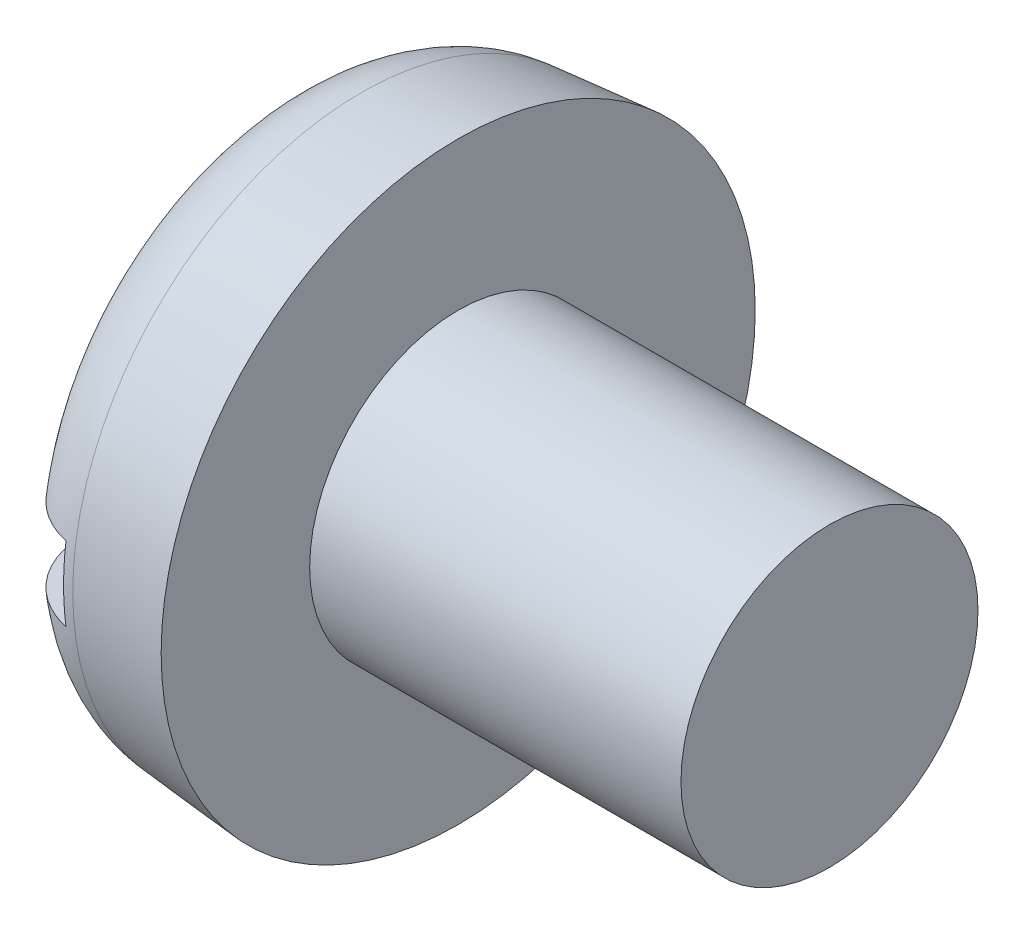
ISO-10303-21;
HEADER;
FILE_DESCRIPTION(('STEP AP214'),'2;1');
FILE_NAME('part.step','',(''),(''),'','','');
FILE_SCHEMA(('AUTOMOTIVE_DESIGN { 1 0 10303 214 1 1 1 1 }'));
ENDSEC;
DATA;
#1=APPLICATION_CONTEXT('core data for automotive mechanical design processes');
#2=APPLICATION_PROTOCOL_DEFINITION('international standard','automotive_design',2000,#1);
#3=PRODUCT_CONTEXT('',#1,'mechanical');
#4=PRODUCT('Part','Part','',(#3));
#5=PRODUCT_RELATED_PRODUCT_CATEGORY('part','',(#4));
#6=PRODUCT_DEFINITION_FORMATION('','',#4);
#7=PRODUCT_DEFINITION_CONTEXT('part definition',#1,'design');
#8=PRODUCT_DEFINITION('design','',#6,#7);
#9=PRODUCT_DEFINITION_SHAPE('','',#8);
#10=(LENGTH_UNIT() NAMED_UNIT(*) SI_UNIT(.MILLI.,.METRE.));
#11=(NAMED_UNIT(*) PLANE_ANGLE_UNIT() SI_UNIT($,.RADIAN.));
#12=(NAMED_UNIT(*) SI_UNIT($,.STERADIAN.) SOLID_ANGLE_UNIT());
#13=UNCERTAINTY_MEASURE_WITH_UNIT(LENGTH_MEASURE(1.E-05),#10,'distance_accuracy_value','');
#14=(GEOMETRIC_REPRESENTATION_CONTEXT(3) GLOBAL_UNCERTAINTY_ASSIGNED_CONTEXT((#13)) GLOBAL_UNIT_ASSIGNED_CONTEXT((#10,
#11,#12)) REPRESENTATION_CONTEXT('',''));
#15=CARTESIAN_POINT('',(0.,0.,0.));
#16=DIRECTION('',(0.,0.,1.));
#17=DIRECTION('',(1.,0.,0.));
#18=AXIS2_PLACEMENT_3D('',#15,#16,#17);
#19=CARTESIAN_POINT('',(0.,0.,0.));
#20=DIRECTION('',(-1.,0.,0.));
#21=DIRECTION('',(0.,0.,1.));
#22=AXIS2_PLACEMENT_3D('',#19,#20,#21);
#23=PLANE('',#22);
#24=DIRECTION('',(0.,0.,-1.));
#25=VECTOR('',#24,1.);
#26=CARTESIAN_POINT('',(0.,0.999999999999999,8.));
#27=LINE('',#26,#25);
#28=CARTESIAN_POINT('',(0.,0.999999999999999,5.28712114550961));
#29=VERTEX_POINT('',#28);
#30=CARTESIAN_POINT('',(0.,0.999999999999999,-5.28712114550961));
#31=VERTEX_POINT('',#30);
#32=EDGE_CURVE('E85',#29,#31,#27,.T.);
#33=ORIENTED_EDGE('',*,*,#32,.F.);
#34=CARTESIAN_POINT('',(0.,0.,0.));
#35=DIRECTION('',(-1.,0.,0.));
#36=DIRECTION('',(0.,0.,1.));
#37=AXIS2_PLACEMENT_3D('',#34,#35,#36);
#38=CIRCLE('',#37,5.38085959743375);
#39=EDGE_CURVE('E91',#29,#31,#38,.T.);
#40=ORIENTED_EDGE('',*,*,#39,.T.);
#41=EDGE_LOOP('',(#33,#40));
#42=FACE_BOUND('',#41,.T.);
#43=ADVANCED_FACE('F32',(#42),#23,.T.);
#44=CARTESIAN_POINT('',(-25.4,0.,0.));
#45=DIRECTION('',(-1.,0.,0.));
#46=DIRECTION('',(0.,0.,1.));
#47=AXIS2_PLACEMENT_3D('',#44,#45,#46);
#48=CYLINDRICAL_SURFACE('',#47,4.);
#49=CARTESIAN_POINT('',(14.8,0.,0.));
#50=DIRECTION('',(-1.,0.,0.));
#51=DIRECTION('',(0.,0.,1.));
#52=AXIS2_PLACEMENT_3D('',#49,#50,#51);
#53=CIRCLE('',#52,4.);
#54=CARTESIAN_POINT('',(14.8,0.,4.));
#55=VERTEX_POINT('',#54);
#56=EDGE_CURVE('E92',#55,#55,#53,.T.);
#57=ORIENTED_EDGE('',*,*,#56,.T.);
#58=EDGE_LOOP('',(#57));
#59=FACE_BOUND('',#58,.T.);
#60=CARTESIAN_POINT('',(4.8,0.,0.));
#61=DIRECTION('',(-1.,0.,0.));
#62=DIRECTION('',(0.,0.,1.));
#63=AXIS2_PLACEMENT_3D('',#60,#61,#62);
#64=CIRCLE('',#63,4.);
#65=CARTESIAN_POINT('',(4.8,0.,4.));
#66=VERTEX_POINT('',#65);
#67=EDGE_CURVE('E149',#66,#66,#64,.T.);
#68=ORIENTED_EDGE('',*,*,#67,.F.);
#69=EDGE_LOOP('',(#68));
#70=FACE_BOUND('',#69,.T.);
#71=ADVANCED_FACE('F137',(#59,#70),#48,.T.);
#72=CARTESIAN_POINT('',(14.8,4.,0.));
#73=DIRECTION('',(1.,0.,0.));
#74=DIRECTION('',(0.,0.,-1.));
#75=AXIS2_PLACEMENT_3D('',#72,#73,#74);
#76=PLANE('',#75);
#77=ORIENTED_EDGE('',*,*,#56,.F.);
#78=EDGE_LOOP('',(#77));
#79=FACE_BOUND('',#78,.T.);
#80=ADVANCED_FACE('F135',(#79),#76,.T.);
#81=DIRECTION('',(0.,0.,1.));
#82=VECTOR('',#81,1.);
#83=CARTESIAN_POINT('',(0.,-0.999999999999999,-8.));
#84=LINE('',#83,#82);
#85=CARTESIAN_POINT('',(0.,-0.999999999999999,-5.28712114550961));
#86=VERTEX_POINT('',#85);
#87=CARTESIAN_POINT('',(0.,-1.,5.28712114550961));
#88=VERTEX_POINT('',#87);
#89=EDGE_CURVE('E76',#86,#88,#84,.T.);
#90=ORIENTED_EDGE('',*,*,#89,.F.);
#91=EDGE_CURVE('E83',#86,#88,#38,.T.);
#92=ORIENTED_EDGE('',*,*,#91,.T.);
#93=EDGE_LOOP('',(#90,#92));
#94=FACE_BOUND('',#93,.T.);
#95=ADVANCED_FACE('F82',(#94),#23,.T.);
#96=CARTESIAN_POINT('',(0.,0.,0.));
#97=DIRECTION('',(1.,0.,0.));
#98=DIRECTION('',(0.,0.,-1.));
#99=AXIS2_PLACEMENT_3D('',#96,#97,#98);
#100=CONICAL_SURFACE('',#99,7.58005441507556,0.0872664625997166);
#101=CARTESIAN_POINT('',(2.19082621740561,0.,0.));
#102=DIRECTION('',(-1.,0.,0.));
#103=DIRECTION('',(0.,0.,1.));
#104=AXIS2_PLACEMENT_3D('',#101,#102,#103);
#105=CIRCLE('',#104,7.77172687285394);
#106=CARTESIAN_POINT('',(2.19082621740561,0.,7.77172687285394));
#107=VERTEX_POINT('',#106);
#108=EDGE_CURVE('E95',#107,#107,#105,.F.);
#109=ORIENTED_EDGE('',*,*,#108,.T.);
#110=EDGE_LOOP('',(#109));
#111=FACE_BOUND('',#110,.T.);
#112=CARTESIAN_POINT('',(4.8,0.,0.));
#113=DIRECTION('',(-1.,0.,0.));
#114=DIRECTION('',(0.,0.,1.));
#115=AXIS2_PLACEMENT_3D('',#112,#113,#114);
#116=CIRCLE('',#115,8.);
#117=CARTESIAN_POINT('',(4.8,0.,8.));
#118=VERTEX_POINT('',#117);
#119=EDGE_CURVE('E97',#118,#118,#116,.T.);
#120=ORIENTED_EDGE('',*,*,#119,.T.);
#121=EDGE_LOOP('',(#120));
#122=FACE_BOUND('',#121,.T.);
#123=ADVANCED_FACE('F128',(#111,#122),#100,.T.);
#124=CARTESIAN_POINT('',(4.8,4.,0.));
#125=DIRECTION('',(-1.,0.,0.));
#126=DIRECTION('',(0.,0.,1.));
#127=AXIS2_PLACEMENT_3D('',#124,#125,#126);
#128=PLANE('',#127);
#129=ORIENTED_EDGE('',*,*,#119,.F.);
#130=EDGE_LOOP('',(#129));
#131=FACE_BOUND('',#130,.T.);
#132=ORIENTED_EDGE('',*,*,#67,.T.);
#133=EDGE_LOOP('',(#132));
#134=FACE_BOUND('',#133,.T.);
#135=ADVANCED_FACE('F124',(#131,#134),#128,.F.);
#136=CARTESIAN_POINT('',(2.4,0.,0.));
#137=DIRECTION('',(-1.,0.,0.));
#138=DIRECTION('',(0.,0.,1.));
#139=AXIS2_PLACEMENT_3D('',#136,#137,#138);
#140=TOROIDAL_SURFACE('',#139,5.38085959743375,2.4);
#141=CARTESIAN_POINT('',(0.725255406221407,0.999999999999999,-7.02916208153497));
#142=CARTESIAN_POINT('',(0.82103971292507,0.999999999999999,-7.12340767349536));
#143=CARTESIAN_POINT('',(0.924805682146405,0.999999999999999,-7.20967378769888));
#144=CARTESIAN_POINT('',(1.14541756360663,0.999999999999999,-7.36365307010391));
#145=CARTESIAN_POINT('',(1.26227783081037,0.999999999999999,-7.43134559064638));
#146=CARTESIAN_POINT('',(1.50570820252025,0.999999999999999,-7.54609816898988));
#147=CARTESIAN_POINT('',(1.63227616123195,0.999999999999999,-7.59316277104451));
#148=CARTESIAN_POINT('',(1.8915043758024,0.999999999999999,-7.66527026246751));
#149=CARTESIAN_POINT('',(2.02416318956274,0.999999999999999,-7.69031833656536));
#150=CARTESIAN_POINT('',(2.29131695770764,0.999999999999999,-7.7176231673501));
#151=CARTESIAN_POINT('',(2.42580346116035,0.999999999999999,-7.71996263084353));
#152=CARTESIAN_POINT('',(2.69325801993518,0.999999999999999,-7.70199615393957));
#153=CARTESIAN_POINT('',(2.82622604430506,0.999999999999999,-7.68168975276478));
#154=CARTESIAN_POINT('',(3.08668283115957,0.999999999999999,-7.61907115879106));
#155=CARTESIAN_POINT('',(3.2141787481316,0.999999999999999,-7.57678871003546));
#156=CARTESIAN_POINT('',(3.46028747537051,0.999999999999999,-7.47147250712997));
#157=CARTESIAN_POINT('',(3.57890026083265,0.999999999999999,-7.40843869503786));
#158=CARTESIAN_POINT('',(3.80422469707934,0.999999999999999,-7.26326356875056));
#159=CARTESIAN_POINT('',(3.91090468612194,0.999999999999999,-7.18107312573391));
#160=CARTESIAN_POINT('',(4.10906261158926,0.999999999999999,-7.00005665428031));
#161=CARTESIAN_POINT('',(4.20054021745233,0.999999999999999,-6.90123026420421));
#162=CARTESIAN_POINT('',(4.36637450383784,0.999999999999999,-6.68906789700964));
#163=CARTESIAN_POINT('',(4.44061347764934,0.999999999999999,-6.57563994024684));
#164=CARTESIAN_POINT('',(4.56922715901077,0.999999999999999,-6.33803696202416));
#165=CARTESIAN_POINT('',(4.62360096912288,0.999999999999999,-6.21386145534138));
#166=CARTESIAN_POINT('',(4.71160353374125,0.999999999999999,-5.95685835217561));
#167=CARTESIAN_POINT('',(4.74500045418445,0.999999999999999,-5.82395140392254));
#168=CARTESIAN_POINT('',(4.78935647196695,0.999999999999999,-5.55444921367288));
#169=CARTESIAN_POINT('',(4.80031401864775,0.999999999999999,-5.41785371744235));
#170=CARTESIAN_POINT('',(4.79966756871007,0.999999999999999,-5.14271101611699));
#171=CARTESIAN_POINT('',(4.78772978691192,0.999999999999999,-5.00416461642975));
#172=CARTESIAN_POINT('',(4.7411384143452,0.999999999999999,-4.73094635272013));
#173=CARTESIAN_POINT('',(4.70648272953905,0.999999999999999,-4.59627484706331));
#174=CARTESIAN_POINT('',(4.61481308734826,0.999999999999999,-4.33239143697964));
#175=CARTESIAN_POINT('',(4.55745664382098,0.999999999999999,-4.2032984450853));
#176=CARTESIAN_POINT('',(4.4220532362234,0.999999999999999,-3.95644544312003));
#177=CARTESIAN_POINT('',(4.34400386476586,0.999999999999999,-3.83868675384063));
#178=CARTESIAN_POINT('',(4.16863426857886,0.999999999999999,-3.61702117671906));
#179=CARTESIAN_POINT('',(4.07117117146151,0.999999999999999,-3.5132271622821));
#180=CARTESIAN_POINT('',(3.85992084926537,0.999999999999999,-3.32380353458495));
#181=CARTESIAN_POINT('',(3.74613391876393,0.999999999999999,-3.23817359360781));
#182=CARTESIAN_POINT('',(3.50747362368414,0.999999999999999,-3.08948780792755));
#183=CARTESIAN_POINT('',(3.38283683522187,0.999999999999999,-3.02605317676383));
#184=CARTESIAN_POINT('',(3.12430171458898,0.999999999999999,-2.92227249010929));
#185=CARTESIAN_POINT('',(2.99040758599054,0.999999999999999,-2.88191603146611));
#186=CARTESIAN_POINT('',(2.724318179949,0.999999999999999,-2.8276035623151));
#187=CARTESIAN_POINT('',(2.59237086295054,0.999999999999999,-2.81243193320244));
#188=CARTESIAN_POINT('',(2.3278713430111,0.999999999999999,-2.80540201657941));
#189=CARTESIAN_POINT('',(2.19531928890944,0.999999999999999,-2.8135382720921));
#190=CARTESIAN_POINT('',(1.93845381371649,0.999999999999999,-2.85198820938825));
#191=CARTESIAN_POINT('',(1.81401621351637,0.999999999999999,-2.88148255319867));
#192=CARTESIAN_POINT('',(1.5716657305366,0.999999999999999,-2.9604624118219));
#193=CARTESIAN_POINT('',(1.45375378801279,0.999999999999999,-3.00995079901385));
#194=CARTESIAN_POINT('',(1.22467001643175,0.999999999999999,-3.12848363781329));
#195=CARTESIAN_POINT('',(1.11372413163819,0.999999999999999,-3.19796373418399));
#196=CARTESIAN_POINT('',(0.904303138278211,0.999999999999999,-3.35368566997277));
#197=CARTESIAN_POINT('',(0.805830807174374,0.999999999999999,-3.43993123172718));
#198=CARTESIAN_POINT('',(0.61884283051151,0.999999999999999,-3.63160255963768));
#199=CARTESIAN_POINT('',(0.531108125319388,0.999999999999999,-3.73779093000753));
#200=CARTESIAN_POINT('',(0.374076347641135,0.999999999999999,-3.96302785723507));
#201=CARTESIAN_POINT('',(0.304782383294116,0.999999999999999,-4.08207857726024));
#202=CARTESIAN_POINT('',(0.18466253133271,0.999999999999999,-4.3335872747523));
#203=CARTESIAN_POINT('',(0.13445318709201,0.999999999999999,-4.46634036208219));
#204=CARTESIAN_POINT('',(0.0570261638471141,0.999999999999999,-4.73839130680937));
#205=CARTESIAN_POINT('',(0.0298081645408796,0.999999999999999,-4.87768907300147));
#206=CARTESIAN_POINT('',(-0.000701668910841978,0.999999999999999,-5.15889684608339));
#207=CARTESIAN_POINT('',(-0.0039925503676615,0.999999999999999,-5.30080695676151));
#208=CARTESIAN_POINT('',(0.0136590580397674,0.999999999999999,-5.58315620677365));
#209=CARTESIAN_POINT('',(0.0346060942908342,0.999999999999999,-5.7235950651534));
#210=CARTESIAN_POINT('',(0.0998602438367204,0.999999999999999,-5.99689113711228));
#211=CARTESIAN_POINT('',(0.143843393519651,0.999999999999999,-6.12982586010097));
#212=CARTESIAN_POINT('',(0.253840252806312,0.999999999999999,-6.38611532470396));
#213=CARTESIAN_POINT('',(0.319825071427148,0.999999999999999,-6.50948236940118));
#214=CARTESIAN_POINT('',(0.443296574397219,0.999999999999999,-6.69904028983212));
#215=CARTESIAN_POINT('',(0.49465889907757,0.999999999999999,-6.76929606306585));
#216=CARTESIAN_POINT('',(0.60465227807632,0.999999999999999,-6.90386862847524));
#217=CARTESIAN_POINT('',(0.663283260478071,0.999999999999999,-6.96818547940007));
#218=CARTESIAN_POINT('',(0.725255406221407,0.999999999999999,-7.02916208153497));
#219=B_SPLINE_CURVE_WITH_KNOTS('',3,(#141,#142,#143,#144,#145,#146,#147,#148,#149,#150,#151,
#152,#153,#154,#155,#156,#157,#158,#159,#160,#161,#162,#163,#164,#165,#166,#167,#168,#169,#170,
#171,#172,#173,#174,#175,#176,#177,#178,#179,#180,#181,#182,#183,#184,#185,#186,#187,#188,#189,
#190,#191,#192,#193,#194,#195,#196,#197,#198,#199,#200,#201,#202,#203,#204,#205,#206,#207,#208,
#209,#210,#211,#212,#213,#214,#215,#216,#217,#218),.UNSPECIFIED.,.T.,.F.,(4,2,2,2,2,2,2,2,2,2,2,
2,2,2,2,2,2,2,2,2,2,2,2,2,2,2,2,2,2,2,2,2,2,2,2,2,2,2,4),(0.,0.402812691132741,0.80607137828855,
1.20924118435122,1.61231602144995,2.01392227040818,2.41553669103305,2.81660894645899,
3.21768232177366,3.61979582740044,4.021918075467,4.42671020813526,4.83152062561928,
5.24072968310801,5.64996701777162,6.06521589709949,6.4805030576476,6.90231029578971,
7.32416662796496,7.74925058125907,8.17432686451887,8.5917474819777,9.00897978641961,
9.4054159883199,9.80175938186666,10.1836532574795,10.5656020161525,10.9566021430148,
11.3476891806602,11.7590531308494,12.1704863715176,12.5942650915887,13.0180379077239,
13.4418275968211,13.8656967904472,14.2837589937038,14.7012743761041,14.9618955011238,
15.2225140477441),.UNSPECIFIED.);
#220=CARTESIAN_POINT('',(1.9,0.999999999999999,-7.66322727754188));
#221=VERTEX_POINT('',#220);
#222=EDGE_CURVE('E11',#31,#221,#219,.T.);
#223=ORIENTED_EDGE('',*,*,#222,.F.);
#224=ORIENTED_EDGE('',*,*,#39,.F.);
#225=CARTESIAN_POINT('',(1.13308555015292,0.999999999999999,3.18940070408419));
#226=CARTESIAN_POINT('',(1.24272549595777,0.999999999999999,3.11798918393752));
#227=CARTESIAN_POINT('',(1.35821082377541,0.999999999999999,3.05542720454714));
#228=CARTESIAN_POINT('',(1.59802387260766,0.999999999999999,2.95026480759933));
#229=CARTESIAN_POINT('',(1.72235656315352,0.999999999999999,2.90767571231328));
#230=CARTESIAN_POINT('',(1.97668495150335,0.999999999999999,2.84421793056552));
#231=CARTESIAN_POINT('',(2.10668898750535,0.999999999999999,2.82338243064525));
#232=CARTESIAN_POINT('',(2.36831421528033,0.999999999999999,2.80454383761957));
#233=CARTESIAN_POINT('',(2.49993491774768,0.999999999999999,2.80653399822418));
#234=CARTESIAN_POINT('',(2.75735707367042,0.999999999999999,2.8328699649383));
#235=CARTESIAN_POINT('',(2.88322020975484,0.999999999999999,2.85662008603347));
#236=CARTESIAN_POINT('',(3.12928491027428,0.999999999999999,2.92459179414385));
#237=CARTESIAN_POINT('',(3.24948556744229,0.999999999999999,2.9688166495019));
#238=CARTESIAN_POINT('',(3.48301527041433,0.999999999999999,3.07687965877457));
#239=CARTESIAN_POINT('',(3.59620512827648,0.999999999999999,3.14101770239585));
#240=CARTESIAN_POINT('',(3.81092918715633,0.999999999999999,3.28648454033722));
#241=CARTESIAN_POINT('',(3.91246090491285,0.999999999999999,3.36781698673561));
#242=CARTESIAN_POINT('',(4.10648204937009,0.999999999999999,3.54991046888707));
#243=CARTESIAN_POINT('',(4.19823409467067,0.999999999999999,3.65145773006192));
#244=CARTESIAN_POINT('',(4.36408761608619,0.999999999999999,3.86807101169455));
#245=CARTESIAN_POINT('',(4.43818587134251,0.999999999999999,3.98313949333175));
#246=CARTESIAN_POINT('',(4.56906897558615,0.999999999999999,4.22788055127873));
#247=CARTESIAN_POINT('',(4.6251703580293,0.999999999999999,4.35791940081076));
#248=CARTESIAN_POINT('',(4.71483837273956,0.999999999999999,4.62555408777189));
#249=CARTESIAN_POINT('',(4.74840402755549,0.999999999999999,4.7631502527075));
#250=CARTESIAN_POINT('',(4.79198053741129,0.999999999999999,5.04252564422967));
#251=CARTESIAN_POINT('',(4.80190921220303,0.999999999999999,5.18431773481283));
#252=CARTESIAN_POINT('',(4.79748494450637,0.999999999999999,5.46752779097671));
#253=CARTESIAN_POINT('',(4.7831333702273,0.999999999999999,5.60894577718872));
#254=CARTESIAN_POINT('',(4.73071847810443,0.999999999999999,5.88539200392825));
#255=CARTESIAN_POINT('',(4.69296974804614,0.999999999999999,6.02047984812353));
#256=CARTESIAN_POINT('',(4.59495946867926,0.999999999999999,6.28222924485552));
#257=CARTESIAN_POINT('',(4.53469981156272,0.999999999999999,6.40889150456432));
#258=CARTESIAN_POINT('',(4.39443443612674,0.999999999999999,6.64804022284089));
#259=CARTESIAN_POINT('',(4.31476014353465,0.999999999999999,6.76072109777192));
#260=CARTESIAN_POINT('',(4.13739426121053,0.999999999999999,6.97087916162181));
#261=CARTESIAN_POINT('',(4.0397039917445,0.999999999999999,7.06835746366628));
#262=CARTESIAN_POINT('',(3.83046290050655,0.999999999999999,7.24402423186367));
#263=CARTESIAN_POINT('',(3.71910846640209,0.999999999999999,7.32244667612165));
#264=CARTESIAN_POINT('',(3.48472229070057,0.999999999999999,7.45929196055859));
#265=CARTESIAN_POINT('',(3.3616911484565,0.999999999999999,7.51771582653491));
#266=CARTESIAN_POINT('',(3.10859231899688,0.999999999999999,7.61240633731203));
#267=CARTESIAN_POINT('',(2.9785944980301,0.999999999999999,7.64885979664785));
#268=CARTESIAN_POINT('',(2.71431337568011,0.999999999999999,7.69931764099452));
#269=CARTESIAN_POINT('',(2.58003020180747,0.999999999999999,7.71332269332307));
#270=CARTESIAN_POINT('',(2.31161693920837,0.999999999999999,7.71845858000263));
#271=CARTESIAN_POINT('',(2.17748874695611,0.999999999999999,7.70968913094903));
#272=CARTESIAN_POINT('',(1.91261263643432,0.999999999999999,7.66974581551766));
#273=CARTESIAN_POINT('',(1.78186468601122,0.999999999999999,7.63857216233468));
#274=CARTESIAN_POINT('',(1.52750062132003,0.999999999999999,7.554751188184));
#275=CARTESIAN_POINT('',(1.40388185352429,0.999999999999999,7.50211191651014));
#276=CARTESIAN_POINT('',(1.16719458632896,0.999999999999999,7.37689717831267));
#277=CARTESIAN_POINT('',(1.05412617269328,0.999999999999999,7.3043215497452));
#278=CARTESIAN_POINT('',(0.841296305863569,0.999999999999999,7.14104556973162));
#279=CARTESIAN_POINT('',(0.741583697198829,0.999999999999999,7.05028156569828));
#280=CARTESIAN_POINT('',(0.558673345299692,0.999999999999999,6.85341490463086));
#281=CARTESIAN_POINT('',(0.475476087545833,0.999999999999999,6.74731179685126));
#282=CARTESIAN_POINT('',(0.327247082964039,0.999999999999999,6.52193012873377));
#283=CARTESIAN_POINT('',(0.26235936422148,0.999999999999999,6.4025568709111));
#284=CARTESIAN_POINT('',(0.153282080271026,0.999999999999999,6.15470618421917));
#285=CARTESIAN_POINT('',(0.10909361923196,0.999999999999999,6.02622827009735));
#286=CARTESIAN_POINT('',(0.0420775723245547,0.999999999999999,5.76219053528217));
#287=CARTESIAN_POINT('',(0.0195105470289371,0.999999999999999,5.62656461415689));
#288=CARTESIAN_POINT('',(-0.00290123063519391,0.999999999999999,5.35345749880995));
#289=CARTESIAN_POINT('',(-0.00274516093288007,0.999999999999999,5.21597623764614));
#290=CARTESIAN_POINT('',(0.0202773948310178,0.999999999999999,4.9408174269515));
#291=CARTESIAN_POINT('',(0.0434903514484618,0.999999999999999,4.80316888747057));
#292=CARTESIAN_POINT('',(0.11235268133059,0.999999999999999,4.53356490790215));
#293=CARTESIAN_POINT('',(0.158009454454297,0.999999999999999,4.40161136110675));
#294=CARTESIAN_POINT('',(0.27127545686549,0.999999999999999,4.14506683067191));
#295=CARTESIAN_POINT('',(0.339210899851546,0.999999999999999,4.02061995430098));
#296=CARTESIAN_POINT('',(0.494899462804128,0.999999999999999,3.78492489636333));
#297=CARTESIAN_POINT('',(0.582633120715179,0.999999999999999,3.67366391551199));
#298=CARTESIAN_POINT('',(0.746760792647136,0.999999999999999,3.49830787378357));
#299=CARTESIAN_POINT('',(0.818747950226991,0.999999999999999,3.4300354384899));
#300=CARTESIAN_POINT('',(0.970401563296177,0.999999999999999,3.30261777069623));
#301=CARTESIAN_POINT('',(1.05006789558639,0.999999999999999,3.24347239180792));
#302=CARTESIAN_POINT('',(1.13308555015292,0.999999999999999,3.18940070408419));
#303=B_SPLINE_CURVE_WITH_KNOTS('',3,(#225,#226,#227,#228,#229,#230,#231,#232,#233,#234,#235,
#236,#237,#238,#239,#240,#241,#242,#243,#244,#245,#246,#247,#248,#249,#250,#251,#252,#253,#254,
#255,#256,#257,#258,#259,#260,#261,#262,#263,#264,#265,#266,#267,#268,#269,#270,#271,#272,#273,
#274,#275,#276,#277,#278,#279,#280,#281,#282,#283,#284,#285,#286,#287,#288,#289,#290,#291,#292,
#293,#294,#295,#296,#297,#298,#299,#300,#301,#302),.UNSPECIFIED.,.T.,.F.,(4,2,2,2,2,2,2,2,2,2,2,
2,2,2,2,2,2,2,2,2,2,2,2,2,2,2,2,2,2,2,2,2,2,2,2,2,2,2,4),(0.,0.392199729791668,0.78462152265516,
1.17764110990256,1.57054454034659,1.95300344459219,2.3355234210851,2.72410905309631,
3.11277730347651,3.5215100908384,3.93031739274461,4.35319132228165,4.77608359211506,
5.20044402580523,5.6247805472792,6.04353181802084,6.4622478978707,6.87426331737677,
7.28624855511986,7.69288575203495,8.09950208797252,8.5026103065357,8.90570654178835,
9.30704082631546,9.70837129186076,10.1095514025206,10.510734774092,10.9133474605093,
11.315971980262,11.72168057531,12.127410809771,12.5379712005151,12.9485464444209,
13.3653860891129,13.7823632605729,14.2057410571698,14.6287044637236,14.925676737218,
15.222644247097),.UNSPECIFIED.);
#304=CARTESIAN_POINT('',(1.9,0.999999999999999,7.66322727754188));
#305=VERTEX_POINT('',#304);
#306=EDGE_CURVE('E109',#305,#29,#303,.T.);
#307=ORIENTED_EDGE('',*,*,#306,.F.);
#308=CARTESIAN_POINT('',(1.9,0.,0.));
#309=DIRECTION('',(-1.,0.,0.));
#310=DIRECTION('',(0.,0.,1.));
#311=AXIS2_PLACEMENT_3D('',#308,#309,#310);
#312=CIRCLE('',#311,7.72819851629485);
#313=CARTESIAN_POINT('',(1.9,-1.,7.66322727754188));
#314=VERTEX_POINT('',#313);
#315=EDGE_CURVE('E103',#305,#314,#312,.F.);
#316=ORIENTED_EDGE('',*,*,#315,.T.);
#317=CARTESIAN_POINT('',(1.13308555015292,-1.,3.18940070408419));
#318=CARTESIAN_POINT('',(1.0158844394699,-1.,3.26574856322953));
#319=CARTESIAN_POINT('',(0.905194684198524,-1.,3.35232569388867));
#320=CARTESIAN_POINT('',(0.69985666779913,-1.,3.54297722513533));
#321=CARTESIAN_POINT('',(0.605237425284382,-1.,3.64708261581538));
#322=CARTESIAN_POINT('',(0.434760304958903,-1.,3.86941910504512));
#323=CARTESIAN_POINT('',(0.358873948945955,-1.,3.98762835162108));
#324=CARTESIAN_POINT('',(0.22774061181619,-1.,4.23492117359429));
#325=CARTESIAN_POINT('',(0.172485538695264,-1.,4.3640004611463));
#326=CARTESIAN_POINT('',(0.0835444414492545,-1.,4.63134434840129));
#327=CARTESIAN_POINT('',(0.0501601836532049,-1.,4.76970955207993));
#328=CARTESIAN_POINT('',(0.00727110532561687,-1.,5.05011074593243));
#329=CARTESIAN_POINT('',(-0.00223225613775864,-1.,5.19214695986103));
#330=CARTESIAN_POINT('',(0.00309582746415235,-1.,5.47474820812885));
#331=CARTESIAN_POINT('',(0.0177528394453326,-1.,5.61531647854312));
#332=CARTESIAN_POINT('',(0.0708484673184948,-1.,5.89189080774848));
#333=CARTESIAN_POINT('',(0.109285068488531,-1.,6.02789725201055));
#334=CARTESIAN_POINT('',(0.208195207124764,-1.,6.28919149665975));
#335=CARTESIAN_POINT('',(0.268311247850396,-1.,6.41461462103048));
#336=CARTESIAN_POINT('',(0.409052803392888,-1.,6.65337361777807));
#337=CARTESIAN_POINT('',(0.489676610722362,-1.,6.76671049534773));
#338=CARTESIAN_POINT('',(0.667837290429984,-1.,6.9763104309236));
#339=CARTESIAN_POINT('',(0.765105889323157,-1.,7.07280156956456));
#340=CARTESIAN_POINT('',(0.974616749439487,-1.,7.24786594757741));
#341=CARTESIAN_POINT('',(1.08685809781521,-1.,7.32644027849727));
#342=CARTESIAN_POINT('',(1.32181133077117,-1.,7.4625715558548));
#343=CARTESIAN_POINT('',(1.44439706483278,-1.,7.52034629051911));
#344=CARTESIAN_POINT('',(1.6975703018605,-1.,7.61434332264518));
#345=CARTESIAN_POINT('',(1.82815747922602,-1.,7.65056649645723));
#346=CARTESIAN_POINT('',(2.09272371813684,-1.,7.70022268679943));
#347=CARTESIAN_POINT('',(2.22667559152917,-1.,7.71380065492764));
#348=CARTESIAN_POINT('',(2.49495259971893,-1.,7.71821769689195));
#349=CARTESIAN_POINT('',(2.62927772732162,-1.,7.70905720603225));
#350=CARTESIAN_POINT('',(2.89416250140507,-1.,7.66831576308481));
#351=CARTESIAN_POINT('',(3.02473014907547,-1.,7.63678679189522));
#352=CARTESIAN_POINT('',(3.2787310014406,-1.,7.55228982628107));
#353=CARTESIAN_POINT('',(3.40216420862115,-1.,7.49932183932642));
#354=CARTESIAN_POINT('',(3.63862340882899,-1.,7.37338944774171));
#355=CARTESIAN_POINT('',(3.75163223570199,-1.,7.30039281997355));
#356=CARTESIAN_POINT('',(3.96387632365781,-1.,7.13656162281368));
#357=CARTESIAN_POINT('',(4.06311132741493,-1.,7.04572672023977));
#358=CARTESIAN_POINT('',(4.24561342815571,-1.,6.84827602499615));
#359=CARTESIAN_POINT('',(4.32878766941683,-1.,6.74157442840766));
#360=CARTESIAN_POINT('',(4.47624250680425,-1.,6.51583534048099));
#361=CARTESIAN_POINT('',(4.54052237229426,-1.,6.39679737234203));
#362=CARTESIAN_POINT('',(4.64907000348683,-1.,6.14853017599559));
#363=CARTESIAN_POINT('',(4.69313508286506,-1.,6.01921236023299));
#364=CARTESIAN_POINT('',(4.75925377766884,-1.,5.75507183571527));
#365=CARTESIAN_POINT('',(4.78130600170584,-1.,5.62024877954549));
#366=CARTESIAN_POINT('',(4.80312194504522,-1.,5.34693189219837));
#367=CARTESIAN_POINT('',(4.80257239291847,-1.,5.20841308387659));
#368=CARTESIAN_POINT('',(4.77860985028463,-1.,4.93336982790255));
#369=CARTESIAN_POINT('',(4.75519488508376,-1.,4.79684555353501));
#370=CARTESIAN_POINT('',(4.68574234526629,-1.,4.5273486355303));
#371=CARTESIAN_POINT('',(4.6393494834394,-1.,4.39446752199702));
#372=CARTESIAN_POINT('',(4.52516136966489,-1.,4.13823315154076));
#373=CARTESIAN_POINT('',(4.45736371985836,-1.,4.01488096401811));
#374=CARTESIAN_POINT('',(4.30136578112254,-1.,3.77985295704887));
#375=CARTESIAN_POINT('',(4.21294939817225,-1.,3.66832040321607));
#376=CARTESIAN_POINT('',(4.01847834306569,-1.,3.46182764494505));
#377=CARTESIAN_POINT('',(3.91242262542354,-1.,3.36686842349469));
#378=CARTESIAN_POINT('',(3.68660400458985,-1.,3.19751984738575));
#379=CARTESIAN_POINT('',(3.56698698433031,-1.,3.12293640955771));
#380=CARTESIAN_POINT('',(3.31650046930039,-1.,2.99597656613765));
#381=CARTESIAN_POINT('',(3.18563564381431,-1.,2.94359099862321));
#382=CARTESIAN_POINT('',(2.92249751717524,-1.,2.86514603727753));
#383=CARTESIAN_POINT('',(2.79053985131954,-1.,2.83802919279673));
#384=CARTESIAN_POINT('',(2.5238856792821,-1.,2.80754348290154));
#385=CARTESIAN_POINT('',(2.38918939579453,-1.,2.80417269423085));
#386=CARTESIAN_POINT('',(2.1274966365317,-1.,2.82094080488613));
#387=CARTESIAN_POINT('',(2.00042944466018,-1.,2.84001309024003));
#388=CARTESIAN_POINT('',(1.75136770099302,-1.,2.89904910426428));
#389=CARTESIAN_POINT('',(1.62936741027434,-1.,2.93898846082054));
#390=CARTESIAN_POINT('',(1.44557133391566,-1.,3.01621493746816));
#391=CARTESIAN_POINT('',(1.38092530772515,-1.,3.04692267426837));
#392=CARTESIAN_POINT('',(1.25464733510661,-1.,3.11399588625483));
#393=CARTESIAN_POINT('',(1.19301518462571,-1.,3.15036097771389));
#394=CARTESIAN_POINT('',(1.13308555015292,-1.,3.18940070408419));
#395=B_SPLINE_CURVE_WITH_KNOTS('',3,(#317,#318,#319,#320,#321,#322,#323,#324,#325,#326,#327,
#328,#329,#330,#331,#332,#333,#334,#335,#336,#337,#338,#339,#340,#341,#342,#343,#344,#345,#346,
#347,#348,#349,#350,#351,#352,#353,#354,#355,#356,#357,#358,#359,#360,#361,#362,#363,#364,#365,
#366,#367,#368,#369,#370,#371,#372,#373,#374,#375,#376,#377,#378,#379,#380,#381,#382,#383,#384,
#385,#386,#387,#388,#389,#390,#391,#392,#393,#394),.UNSPECIFIED.,.T.,.F.,(4,2,2,2,2,2,2,2,2,2,2,
2,2,2,2,2,2,2,2,2,2,2,2,2,2,2,2,2,2,2,2,2,2,2,2,2,2,2,4),(0.,0.419355166637373,
0.839459695189693,1.25892158188551,1.67821877393885,2.10318582194312,2.52817883383111,
2.95011689920865,3.37201922084484,3.78726060584403,4.2024674289384,4.61152273122236,
5.0205531059156,5.42516668541343,5.82976381100014,6.23176103481969,6.63375056287878,
7.03480897627501,7.43586724993233,7.83757458963325,8.23928943311293,8.6432614862344,
9.04724915870336,9.45520339846003,9.86318342255555,10.2768201258614,10.6904925546564,
11.1107708766069,11.5310962967076,11.9560423738708,12.3810136466297,12.8017834234075,
13.2223793626116,13.6244590577306,14.0265061869699,14.4101925665059,14.7934318103443,
15.0078794868023,15.2223126240345),.UNSPECIFIED.);
#396=EDGE_CURVE('E90',#88,#314,#395,.T.);
#397=ORIENTED_EDGE('',*,*,#396,.F.);
#398=ORIENTED_EDGE('',*,*,#91,.F.);
#399=CARTESIAN_POINT('',(0.725255406221407,-0.999999999999999,-7.02916208153497));
#400=CARTESIAN_POINT('',(0.628097268572646,-0.999999999999999,-6.93354735278604));
#401=CARTESIAN_POINT('',(0.539009537857229,-0.999999999999999,-6.82957824255818));
#402=CARTESIAN_POINT('',(0.37955166635671,-0.999999999999999,-6.60802398355226));
#403=CARTESIAN_POINT('',(0.309206699676166,-0.999999999999999,-6.49042082341565));
#404=CARTESIAN_POINT('',(0.189269733175565,-0.999999999999999,-6.24521397703886));
#405=CARTESIAN_POINT('',(0.139656458164175,-0.999999999999999,-6.1176207033147));
#406=CARTESIAN_POINT('',(0.0623357627134293,-0.999999999999999,-5.85601084532815));
#407=CARTESIAN_POINT('',(0.0346228729482672,-0.999999999999999,-5.72199587367111));
#408=CARTESIAN_POINT('',(0.00149645168023765,-0.999999999999999,-5.44985758422916));
#409=CARTESIAN_POINT('',(-0.00368739248942208,-0.999999999999999,-5.31170634337572));
#410=CARTESIAN_POINT('',(0.00882724584038081,-0.999999999999999,-5.03644099798617));
#411=CARTESIAN_POINT('',(0.026528605497963,-0.999999999999999,-4.89932702603692));
#412=CARTESIAN_POINT('',(0.0846300041690709,-0.999999999999999,-4.627706075801));
#413=CARTESIAN_POINT('',(0.125387578088182,-0.999999999999999,-4.49327555938383));
#414=CARTESIAN_POINT('',(0.228612245539429,-0.999999999999999,-4.2330183081871));
#415=CARTESIAN_POINT('',(0.291081623528072,-0.999999999999999,-4.10719248043718));
#416=CARTESIAN_POINT('',(0.436890737627325,-0.999999999999999,-3.86614036367113));
#417=CARTESIAN_POINT('',(0.52047769076046,-0.999999999999999,-3.75106345868643));
#418=CARTESIAN_POINT('',(0.705892364597571,-0.999999999999999,-3.53664807941638));
#419=CARTESIAN_POINT('',(0.807721521176893,-0.999999999999999,-3.43731084518842));
#420=CARTESIAN_POINT('',(1.02625711762127,-0.999999999999999,-3.2581265821788));
#421=CARTESIAN_POINT('',(1.14286736809801,-0.999999999999999,-3.17816249201398));
#422=CARTESIAN_POINT('',(1.38829744841515,-0.999999999999999,-3.03988767810072));
#423=CARTESIAN_POINT('',(1.51711349558055,-0.999999999999999,-2.98157027324152));
#424=CARTESIAN_POINT('',(1.7778328471511,-0.999999999999999,-2.8909792820712));
#425=CARTESIAN_POINT('',(1.90940522306088,-0.999999999999999,-2.85775512636446));
#426=CARTESIAN_POINT('',(2.17633979979327,-0.999999999999999,-2.81517445249558));
#427=CARTESIAN_POINT('',(2.31170043606816,-0.999999999999999,-2.80580822390887));
#428=CARTESIAN_POINT('',(2.57520214164859,-0.999999999999999,-2.81125711902434));
#429=CARTESIAN_POINT('',(2.70336916477033,-0.999999999999999,-2.82489916675503));
#430=CARTESIAN_POINT('',(2.95558201178676,-0.999999999999999,-2.87351438807454));
#431=CARTESIAN_POINT('',(3.07962762012905,-0.999999999999999,-2.90848867550603));
#432=CARTESIAN_POINT('',(3.32035602743698,-0.999999999999999,-2.99833490042209));
#433=CARTESIAN_POINT('',(3.43703350494972,-0.999999999999999,-3.0532210300764));
#434=CARTESIAN_POINT('',(3.66012170287401,-0.999999999999999,-3.18091247417619));
#435=CARTESIAN_POINT('',(3.76653029175016,-0.999999999999999,-3.25372149782637));
#436=CARTESIAN_POINT('',(3.97155137105138,-0.999999999999999,-3.41896434165876));
#437=CARTESIAN_POINT('',(4.06953401578623,-0.999999999999999,-3.51217969373249));
#438=CARTESIAN_POINT('',(4.24924087689809,-0.999999999999999,-3.7131504141896));
#439=CARTESIAN_POINT('',(4.33096176265136,-0.999999999999999,-3.8209087536006));
#440=CARTESIAN_POINT('',(4.4791730788094,-0.999999999999999,-4.05280823330806));
#441=CARTESIAN_POINT('',(4.5448925134889,-0.999999999999999,-4.17744305981295));
#442=CARTESIAN_POINT('',(4.65471911758685,-0.999999999999999,-4.43590334674795));
#443=CARTESIAN_POINT('',(4.69882463916183,-0.999999999999999,-4.56972950703824));
#444=CARTESIAN_POINT('',(4.76440958336565,-0.999999999999999,-4.84423357408241));
#445=CARTESIAN_POINT('',(4.78566055525708,-0.999999999999999,-4.98496621998978));
#446=CARTESIAN_POINT('',(4.80395901134117,-0.999999999999999,-5.26800202418339));
#447=CARTESIAN_POINT('',(4.80100745442252,-0.999999999999999,-5.41030512002635));
#448=CARTESIAN_POINT('',(4.77094970379867,-0.999999999999999,-5.69078990909059));
#449=CARTESIAN_POINT('',(4.74410434483464,-0.999999999999999,-5.82899949877085));
#450=CARTESIAN_POINT('',(4.66720507095307,-0.999999999999999,-6.09880756732428));
#451=CARTESIAN_POINT('',(4.61715309372228,-0.999999999999999,-6.23040659714383));
#452=CARTESIAN_POINT('',(4.49614183914794,-0.999999999999999,-6.48099615904748));
#453=CARTESIAN_POINT('',(4.42553263332986,-0.999999999999999,-6.60015575824552));
#454=CARTESIAN_POINT('',(4.26504381514696,-0.999999999999999,-6.82470494384461));
#455=CARTESIAN_POINT('',(4.17516565981037,-0.999999999999999,-6.93009557042205));
#456=CARTESIAN_POINT('',(3.98005728160979,-0.999999999999999,-7.12257754210622));
#457=CARTESIAN_POINT('',(3.87505806106831,-0.999999999999999,-7.20990309408545));
#458=CARTESIAN_POINT('',(3.65176880276245,-0.999999999999999,-7.36548077218432));
#459=CARTESIAN_POINT('',(3.53347949114893,-0.999999999999999,-7.43373393968085));
#460=CARTESIAN_POINT('',(3.28820507874633,-0.999999999999999,-7.54856442550922));
#461=CARTESIAN_POINT('',(3.16131485186775,-0.999999999999999,-7.59534445630394));
#462=CARTESIAN_POINT('',(2.90146304182193,-0.999999999999999,-7.66680637944339));
#463=CARTESIAN_POINT('',(2.76850191691624,-0.999999999999999,-7.69148993685094));
#464=CARTESIAN_POINT('',(2.50105523006454,-0.999999999999999,-7.7179585712332));
#465=CARTESIAN_POINT('',(2.36658193189989,-0.999999999999999,-7.71986775986516));
#466=CARTESIAN_POINT('',(2.09919210097257,-0.999999999999999,-7.70104800837434));
#467=CARTESIAN_POINT('',(1.96627595517896,-0.999999999999999,-7.68031355682214));
#468=CARTESIAN_POINT('',(1.70593441261155,-0.999999999999999,-7.61684503579622));
#469=CARTESIAN_POINT('',(1.57850467650122,-0.999999999999999,-7.5741287120687));
#470=CARTESIAN_POINT('',(1.33271846395474,-0.999999999999999,-7.46798097356681));
#471=CARTESIAN_POINT('',(1.21435092815572,-0.999999999999999,-7.40457532178255));
#472=CARTESIAN_POINT('',(1.03445756937212,-0.999999999999999,-7.28787042528777));
#473=CARTESIAN_POINT('',(0.968993156178487,-0.999999999999999,-7.24052162966961));
#474=CARTESIAN_POINT('',(0.843160858650378,-0.999999999999999,-7.13947921665093));
#475=CARTESIAN_POINT('',(0.782792958442258,-0.999999999999999,-7.08578561901324));
#476=CARTESIAN_POINT('',(0.725255406221407,-0.999999999999999,-7.02916208153497));
#477=B_SPLINE_CURVE_WITH_KNOTS('',3,(#399,#400,#401,#402,#403,#404,#405,#406,#407,#408,#409,
#410,#411,#412,#413,#414,#415,#416,#417,#418,#419,#420,#421,#422,#423,#424,#425,#426,#427,#428,
#429,#430,#431,#432,#433,#434,#435,#436,#437,#438,#439,#440,#441,#442,#443,#444,#445,#446,#447,
#448,#449,#450,#451,#452,#453,#454,#455,#456,#457,#458,#459,#460,#461,#462,#463,#464,#465,#466,
#467,#468,#469,#470,#471,#472,#473,#474,#475,#476),.UNSPECIFIED.,.T.,.F.,(4,2,2,2,2,2,2,2,2,2,2,
2,2,2,2,2,2,2,2,2,2,2,2,2,2,2,2,2,2,2,2,2,2,2,2,2,2,2,4),(0.,0.408646909372474,
0.817839951932527,1.22661203666118,1.63528200378618,2.04810879772396,2.46098749784015,
2.88045150577869,3.29995966193801,3.7246269571166,4.14932769329001,4.57139433974967,
4.99333060950996,5.3983474867882,5.80319949162408,6.18802788514237,6.57287637383053,
6.95799970400968,7.34320280389599,7.74711875627215,8.15111735103271,8.57184862320393,
8.99261196691393,9.41754318779235,9.84245757324944,10.2627895435816,10.6830864237063,
11.096607378698,11.5100970761821,11.9178336332295,12.3255479229807,12.7293298440825,
13.1330813359449,13.5346315239404,13.9362794704614,14.337603678086,14.7384300394446,
14.9804336090091,15.222436424799),.UNSPECIFIED.);
#478=CARTESIAN_POINT('',(1.9,-0.999999999999999,-7.66322727754188));
#479=VERTEX_POINT('',#478);
#480=EDGE_CURVE('E44',#479,#86,#477,.T.);
#481=ORIENTED_EDGE('',*,*,#480,.F.);
#482=EDGE_CURVE('E56',#479,#221,#312,.F.);
#483=ORIENTED_EDGE('',*,*,#482,.T.);
#484=EDGE_LOOP('',(#223,#224,#307,#316,#397,#398,#481,#483));
#485=FACE_BOUND('',#484,.T.);
#486=ORIENTED_EDGE('',*,*,#108,.F.);
#487=EDGE_LOOP('',(#486));
#488=FACE_BOUND('',#487,.T.);
#489=ADVANCED_FACE('F34',(#485,#488),#140,.T.);
#490=CARTESIAN_POINT('',(1.9,0.999999999999999,8.));
#491=DIRECTION('',(0.,1.,0.));
#492=DIRECTION('',(0.,0.,1.));
#493=AXIS2_PLACEMENT_3D('',#490,#491,#492);
#494=PLANE('',#493);
#495=ORIENTED_EDGE('',*,*,#222,.T.);
#496=DIRECTION('',(0.,0.,-1.));
#497=VECTOR('',#496,1.);
#498=CARTESIAN_POINT('',(1.9,0.999999999999999,8.));
#499=LINE('',#498,#497);
#500=EDGE_CURVE('E84',#305,#221,#499,.T.);
#501=ORIENTED_EDGE('',*,*,#500,.F.);
#502=ORIENTED_EDGE('',*,*,#306,.T.);
#503=ORIENTED_EDGE('',*,*,#32,.T.);
#504=EDGE_LOOP('',(#495,#501,#502,#503));
#505=FACE_BOUND('',#504,.T.);
#506=ADVANCED_FACE('F116',(#505),#494,.F.);
#507=CARTESIAN_POINT('',(1.9,-0.999999999999999,-8.));
#508=DIRECTION('',(0.,-1.,0.));
#509=DIRECTION('',(0.,0.,-1.));
#510=AXIS2_PLACEMENT_3D('',#507,#508,#509);
#511=PLANE('',#510);
#512=ORIENTED_EDGE('',*,*,#480,.T.);
#513=ORIENTED_EDGE('',*,*,#89,.T.);
#514=ORIENTED_EDGE('',*,*,#396,.T.);
#515=DIRECTION('',(0.,0.,1.));
#516=VECTOR('',#515,1.);
#517=CARTESIAN_POINT('',(1.9,-0.999999999999999,-8.));
#518=LINE('',#517,#516);
#519=EDGE_CURVE('E51',#479,#314,#518,.T.);
#520=ORIENTED_EDGE('',*,*,#519,.F.);
#521=EDGE_LOOP('',(#512,#513,#514,#520));
#522=FACE_BOUND('',#521,.T.);
#523=ADVANCED_FACE('F75',(#522),#511,.F.);
#524=CARTESIAN_POINT('',(1.9,0.999999999999999,-8.));
#525=DIRECTION('',(-1.,0.,0.));
#526=DIRECTION('',(0.,0.,1.));
#527=AXIS2_PLACEMENT_3D('',#524,#525,#526);
#528=PLANE('',#527);
#529=ORIENTED_EDGE('',*,*,#519,.T.);
#530=ORIENTED_EDGE('',*,*,#315,.F.);
#531=ORIENTED_EDGE('',*,*,#500,.T.);
#532=ORIENTED_EDGE('',*,*,#482,.F.);
#533=EDGE_LOOP('',(#529,#530,#531,#532));
#534=FACE_BOUND('',#533,.T.);
#535=ADVANCED_FACE('F115',(#534),#528,.T.);
#536=CLOSED_SHELL('',(#43,#71,#80,#95,#123,#135,#489,#506,#523,#535));
#537=MANIFOLD_SOLID_BREP('B2',#536);
#538=ADVANCED_BREP_SHAPE_REPRESENTATION('',(#18,#537),#14);
#539=SHAPE_DEFINITION_REPRESENTATION(#9,#538);
ENDSEC;
END-ISO-10303-21;
